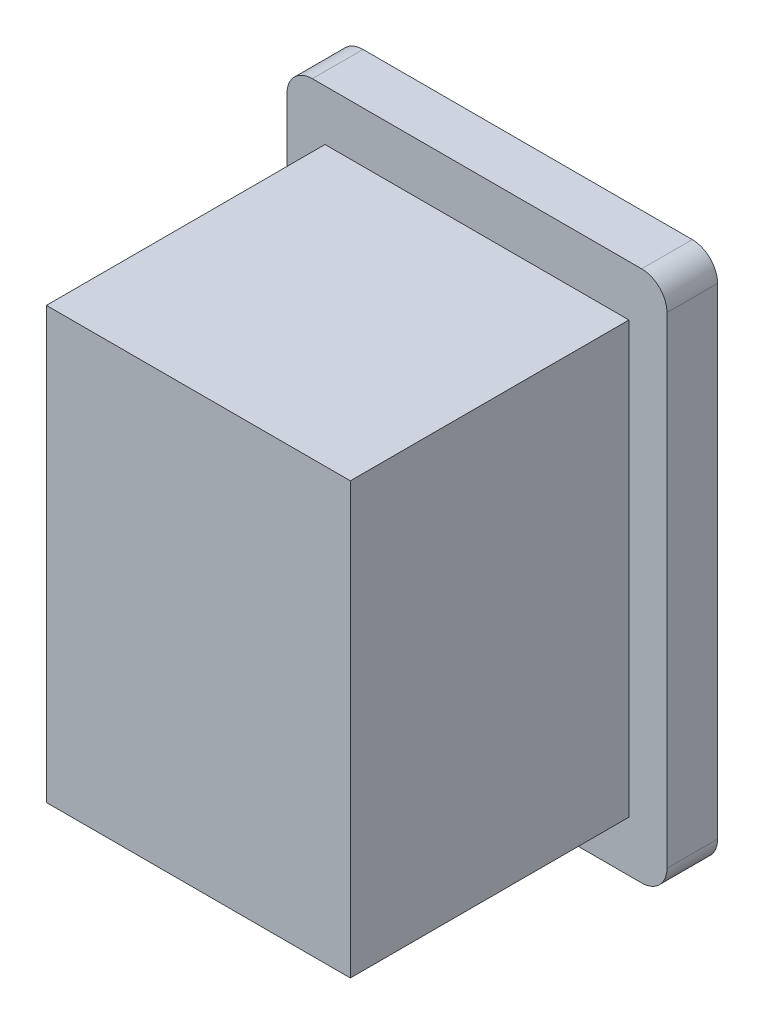
ISO-10303-21;
HEADER;
FILE_DESCRIPTION(('STEP AP214'),'2;1');
FILE_NAME('part.step','',(''),(''),'','','');
FILE_SCHEMA(('AUTOMOTIVE_DESIGN { 1 0 10303 214 1 1 1 1 }'));
ENDSEC;
DATA;
#1=APPLICATION_CONTEXT('core data for automotive mechanical design processes');
#2=APPLICATION_PROTOCOL_DEFINITION('international standard','automotive_design',2000,#1);
#3=PRODUCT_CONTEXT('',#1,'mechanical');
#4=PRODUCT('Part','Part','',(#3));
#5=PRODUCT_RELATED_PRODUCT_CATEGORY('part','',(#4));
#6=PRODUCT_DEFINITION_FORMATION('','',#4);
#7=PRODUCT_DEFINITION_CONTEXT('part definition',#1,'design');
#8=PRODUCT_DEFINITION('design','',#6,#7);
#9=PRODUCT_DEFINITION_SHAPE('','',#8);
#10=(LENGTH_UNIT() NAMED_UNIT(*) SI_UNIT(.MILLI.,.METRE.));
#11=(NAMED_UNIT(*) PLANE_ANGLE_UNIT() SI_UNIT($,.RADIAN.));
#12=(NAMED_UNIT(*) SI_UNIT($,.STERADIAN.) SOLID_ANGLE_UNIT());
#13=UNCERTAINTY_MEASURE_WITH_UNIT(LENGTH_MEASURE(1.E-05),#10,'distance_accuracy_value','');
#14=(GEOMETRIC_REPRESENTATION_CONTEXT(3) GLOBAL_UNCERTAINTY_ASSIGNED_CONTEXT((#13)) GLOBAL_UNIT_ASSIGNED_CONTEXT((#10,
#11,#12)) REPRESENTATION_CONTEXT('',''));
#15=CARTESIAN_POINT('',(0.,0.,0.));
#16=DIRECTION('',(0.,0.,1.));
#17=DIRECTION('',(1.,0.,0.));
#18=AXIS2_PLACEMENT_3D('',#15,#16,#17);
#19=CARTESIAN_POINT('',(6.,8.5,13.));
#20=DIRECTION('',(-1.,0.,0.));
#21=DIRECTION('',(0.,-1.,0.));
#22=AXIS2_PLACEMENT_3D('',#19,#20,#21);
#23=PLANE('',#22);
#24=DIRECTION('',(0.,0.,-1.));
#25=VECTOR('',#24,1.);
#26=CARTESIAN_POINT('',(6.,-8.5,13.));
#27=LINE('',#26,#25);
#28=CARTESIAN_POINT('',(6.,-8.5,13.));
#29=VERTEX_POINT('',#28);
#30=CARTESIAN_POINT('',(6.,-8.5,2.));
#31=VERTEX_POINT('',#30);
#32=EDGE_CURVE('E151',#29,#31,#27,.T.);
#33=ORIENTED_EDGE('',*,*,#32,.T.);
#34=DIRECTION('',(0.,1.,0.));
#35=VECTOR('',#34,1.);
#36=CARTESIAN_POINT('',(6.,8.5,2.));
#37=LINE('',#36,#35);
#38=CARTESIAN_POINT('',(6.,8.5,2.));
#39=VERTEX_POINT('',#38);
#40=EDGE_CURVE('E129',#31,#39,#37,.T.);
#41=ORIENTED_EDGE('',*,*,#40,.T.);
#42=DIRECTION('',(0.,0.,-1.));
#43=VECTOR('',#42,1.);
#44=CARTESIAN_POINT('',(6.,8.5,13.));
#45=LINE('',#44,#43);
#46=CARTESIAN_POINT('',(6.,8.5,13.));
#47=VERTEX_POINT('',#46);
#48=EDGE_CURVE('E135',#47,#39,#45,.T.);
#49=ORIENTED_EDGE('',*,*,#48,.F.);
#50=DIRECTION('',(0.,1.,0.));
#51=VECTOR('',#50,1.);
#52=CARTESIAN_POINT('',(6.,8.5,13.));
#53=LINE('',#52,#51);
#54=EDGE_CURVE('E211',#29,#47,#53,.T.);
#55=ORIENTED_EDGE('',*,*,#54,.F.);
#56=EDGE_LOOP('',(#33,#41,#49,#55));
#57=FACE_BOUND('',#56,.T.);
#58=ADVANCED_FACE('F35',(#57),#23,.F.);
#59=CARTESIAN_POINT('',(-6.,8.5,13.));
#60=DIRECTION('',(0.,-1.,0.));
#61=DIRECTION('',(0.,0.,-1.));
#62=AXIS2_PLACEMENT_3D('',#59,#60,#61);
#63=PLANE('',#62);
#64=ORIENTED_EDGE('',*,*,#48,.T.);
#65=DIRECTION('',(-1.,0.,0.));
#66=VECTOR('',#65,1.);
#67=CARTESIAN_POINT('',(-6.,8.5,2.));
#68=LINE('',#67,#66);
#69=CARTESIAN_POINT('',(-6.,8.5,2.));
#70=VERTEX_POINT('',#69);
#71=EDGE_CURVE('E146',#39,#70,#68,.T.);
#72=ORIENTED_EDGE('',*,*,#71,.T.);
#73=DIRECTION('',(0.,0.,-1.));
#74=VECTOR('',#73,1.);
#75=CARTESIAN_POINT('',(-6.,8.5,13.));
#76=LINE('',#75,#74);
#77=CARTESIAN_POINT('',(-6.,8.5,13.));
#78=VERTEX_POINT('',#77);
#79=EDGE_CURVE('E145',#78,#70,#76,.T.);
#80=ORIENTED_EDGE('',*,*,#79,.F.);
#81=DIRECTION('',(-1.,0.,0.));
#82=VECTOR('',#81,1.);
#83=CARTESIAN_POINT('',(-6.,8.5,13.));
#84=LINE('',#83,#82);
#85=EDGE_CURVE('E214',#47,#78,#84,.T.);
#86=ORIENTED_EDGE('',*,*,#85,.F.);
#87=EDGE_LOOP('',(#64,#72,#80,#86));
#88=FACE_BOUND('',#87,.T.);
#89=ADVANCED_FACE('F223',(#88),#63,.F.);
#90=CARTESIAN_POINT('',(-6.,8.5,13.));
#91=DIRECTION('',(1.,0.,0.));
#92=DIRECTION('',(0.,1.,0.));
#93=AXIS2_PLACEMENT_3D('',#90,#91,#92);
#94=PLANE('',#93);
#95=ORIENTED_EDGE('',*,*,#79,.T.);
#96=DIRECTION('',(0.,-1.,0.));
#97=VECTOR('',#96,1.);
#98=CARTESIAN_POINT('',(-6.,8.5,2.));
#99=LINE('',#98,#97);
#100=CARTESIAN_POINT('',(-6.,-8.5,2.));
#101=VERTEX_POINT('',#100);
#102=EDGE_CURVE('E126',#70,#101,#99,.T.);
#103=ORIENTED_EDGE('',*,*,#102,.T.);
#104=DIRECTION('',(0.,0.,-1.));
#105=VECTOR('',#104,1.);
#106=CARTESIAN_POINT('',(-6.,-8.5,13.));
#107=LINE('',#106,#105);
#108=CARTESIAN_POINT('',(-6.,-8.5,13.));
#109=VERTEX_POINT('',#108);
#110=EDGE_CURVE('E142',#109,#101,#107,.T.);
#111=ORIENTED_EDGE('',*,*,#110,.F.);
#112=DIRECTION('',(0.,-1.,0.));
#113=VECTOR('',#112,1.);
#114=CARTESIAN_POINT('',(-6.,8.5,13.));
#115=LINE('',#114,#113);
#116=EDGE_CURVE('E216',#78,#109,#115,.T.);
#117=ORIENTED_EDGE('',*,*,#116,.F.);
#118=EDGE_LOOP('',(#95,#103,#111,#117));
#119=FACE_BOUND('',#118,.T.);
#120=ADVANCED_FACE('F140',(#119),#94,.F.);
#121=CARTESIAN_POINT('',(-6.,-8.5,13.));
#122=DIRECTION('',(0.,1.,0.));
#123=DIRECTION('',(0.,0.,1.));
#124=AXIS2_PLACEMENT_3D('',#121,#122,#123);
#125=PLANE('',#124);
#126=ORIENTED_EDGE('',*,*,#110,.T.);
#127=DIRECTION('',(1.,0.,0.));
#128=VECTOR('',#127,1.);
#129=CARTESIAN_POINT('',(-6.,-8.5,2.));
#130=LINE('',#129,#128);
#131=EDGE_CURVE('E123',#101,#31,#130,.T.);
#132=ORIENTED_EDGE('',*,*,#131,.T.);
#133=ORIENTED_EDGE('',*,*,#32,.F.);
#134=DIRECTION('',(1.,0.,0.));
#135=VECTOR('',#134,1.);
#136=CARTESIAN_POINT('',(-6.,-8.5,13.));
#137=LINE('',#136,#135);
#138=EDGE_CURVE('E150',#109,#29,#137,.T.);
#139=ORIENTED_EDGE('',*,*,#138,.F.);
#140=EDGE_LOOP('',(#126,#132,#133,#139));
#141=FACE_BOUND('',#140,.T.);
#142=ADVANCED_FACE('F149',(#141),#125,.F.);
#143=CARTESIAN_POINT('',(0.,0.,13.));
#144=DIRECTION('',(0.,0.,1.));
#145=DIRECTION('',(1.,0.,0.));
#146=AXIS2_PLACEMENT_3D('',#143,#144,#145);
#147=PLANE('',#146);
#148=ORIENTED_EDGE('',*,*,#54,.T.);
#149=ORIENTED_EDGE('',*,*,#85,.T.);
#150=ORIENTED_EDGE('',*,*,#116,.T.);
#151=ORIENTED_EDGE('',*,*,#138,.T.);
#152=EDGE_LOOP('',(#148,#149,#150,#151));
#153=FACE_BOUND('',#152,.T.);
#154=ADVANCED_FACE('F218',(#153),#147,.T.);
#155=CARTESIAN_POINT('',(0.,0.,2.));
#156=DIRECTION('',(0.,0.,1.));
#157=DIRECTION('',(1.,0.,0.));
#158=AXIS2_PLACEMENT_3D('',#155,#156,#157);
#159=PLANE('',#158);
#160=DIRECTION('',(0.,-1.,0.));
#161=VECTOR('',#160,1.);
#162=CARTESIAN_POINT('',(-7.5,-10.5,2.));
#163=LINE('',#162,#161);
#164=CARTESIAN_POINT('',(-7.5,9.49999999999999,2.));
#165=VERTEX_POINT('',#164);
#166=CARTESIAN_POINT('',(-7.5,-9.5,2.));
#167=VERTEX_POINT('',#166);
#168=EDGE_CURVE('E199',#165,#167,#163,.T.);
#169=ORIENTED_EDGE('',*,*,#168,.T.);
#170=CARTESIAN_POINT('',(-6.5,-9.5,2.));
#171=DIRECTION('',(0.,0.,1.));
#172=DIRECTION('',(1.,0.,0.));
#173=AXIS2_PLACEMENT_3D('',#170,#171,#172);
#174=CIRCLE('',#173,1.);
#175=CARTESIAN_POINT('',(-6.5,-10.5,2.));
#176=VERTEX_POINT('',#175);
#177=EDGE_CURVE('E181',#167,#176,#174,.T.);
#178=ORIENTED_EDGE('',*,*,#177,.T.);
#179=DIRECTION('',(1.,0.,0.));
#180=VECTOR('',#179,1.);
#181=CARTESIAN_POINT('',(7.5,-10.5,2.));
#182=LINE('',#181,#180);
#183=CARTESIAN_POINT('',(6.5,-10.5,2.));
#184=VERTEX_POINT('',#183);
#185=EDGE_CURVE('E203',#176,#184,#182,.T.);
#186=ORIENTED_EDGE('',*,*,#185,.T.);
#187=CARTESIAN_POINT('',(6.5,-9.5,2.));
#188=DIRECTION('',(0.,0.,1.));
#189=DIRECTION('',(1.,0.,0.));
#190=AXIS2_PLACEMENT_3D('',#187,#188,#189);
#191=CIRCLE('',#190,1.);
#192=CARTESIAN_POINT('',(7.5,-9.5,2.));
#193=VERTEX_POINT('',#192);
#194=EDGE_CURVE('E179',#184,#193,#191,.T.);
#195=ORIENTED_EDGE('',*,*,#194,.T.);
#196=DIRECTION('',(0.,1.,0.));
#197=VECTOR('',#196,1.);
#198=CARTESIAN_POINT('',(7.5,-10.5,2.));
#199=LINE('',#198,#197);
#200=CARTESIAN_POINT('',(7.5,9.49999999999999,2.));
#201=VERTEX_POINT('',#200);
#202=EDGE_CURVE('E264',#193,#201,#199,.T.);
#203=ORIENTED_EDGE('',*,*,#202,.T.);
#204=CARTESIAN_POINT('',(6.5,9.5,2.));
#205=DIRECTION('',(0.,0.,1.));
#206=DIRECTION('',(1.,0.,0.));
#207=AXIS2_PLACEMENT_3D('',#204,#205,#206);
#208=CIRCLE('',#207,1.);
#209=CARTESIAN_POINT('',(6.5,10.5,2.));
#210=VERTEX_POINT('',#209);
#211=EDGE_CURVE('E55',#201,#210,#208,.T.);
#212=ORIENTED_EDGE('',*,*,#211,.T.);
#213=DIRECTION('',(-1.,0.,0.));
#214=VECTOR('',#213,1.);
#215=CARTESIAN_POINT('',(7.5,10.5,2.));
#216=LINE('',#215,#214);
#217=CARTESIAN_POINT('',(-6.5,10.5,2.));
#218=VERTEX_POINT('',#217);
#219=EDGE_CURVE('E147',#210,#218,#216,.T.);
#220=ORIENTED_EDGE('',*,*,#219,.T.);
#221=CARTESIAN_POINT('',(-6.5,9.5,2.));
#222=DIRECTION('',(0.,0.,1.));
#223=DIRECTION('',(1.,0.,0.));
#224=AXIS2_PLACEMENT_3D('',#221,#222,#223);
#225=CIRCLE('',#224,1.);
#226=EDGE_CURVE('E177',#218,#165,#225,.T.);
#227=ORIENTED_EDGE('',*,*,#226,.T.);
#228=EDGE_LOOP('',(#169,#178,#186,#195,#203,#212,#220,#227));
#229=FACE_BOUND('',#228,.T.);
#230=ORIENTED_EDGE('',*,*,#40,.F.);
#231=ORIENTED_EDGE('',*,*,#131,.F.);
#232=ORIENTED_EDGE('',*,*,#102,.F.);
#233=ORIENTED_EDGE('',*,*,#71,.F.);
#234=EDGE_LOOP('',(#230,#231,#232,#233));
#235=FACE_BOUND('',#234,.T.);
#236=ADVANCED_FACE('F125',(#229,#235),#159,.T.);
#237=CARTESIAN_POINT('',(-7.5,-10.5,2.));
#238=DIRECTION('',(1.,0.,0.));
#239=DIRECTION('',(0.,0.,-1.));
#240=AXIS2_PLACEMENT_3D('',#237,#238,#239);
#241=PLANE('',#240);
#242=DIRECTION('',(0.,-1.,0.));
#243=VECTOR('',#242,1.);
#244=CARTESIAN_POINT('',(-7.5,-10.5,0.));
#245=LINE('',#244,#243);
#246=CARTESIAN_POINT('',(-7.5,9.49999999999999,0.));
#247=VERTEX_POINT('',#246);
#248=CARTESIAN_POINT('',(-7.5,-9.5,0.));
#249=VERTEX_POINT('',#248);
#250=EDGE_CURVE('E255',#247,#249,#245,.T.);
#251=ORIENTED_EDGE('',*,*,#250,.T.);
#252=DIRECTION('',(0.,0.,-1.));
#253=VECTOR('',#252,1.);
#254=CARTESIAN_POINT('',(-7.5,-9.5,2.));
#255=LINE('',#254,#253);
#256=EDGE_CURVE('E174',#249,#167,#255,.F.);
#257=ORIENTED_EDGE('',*,*,#256,.T.);
#258=ORIENTED_EDGE('',*,*,#168,.F.);
#259=DIRECTION('',(0.,0.,-1.));
#260=VECTOR('',#259,1.);
#261=CARTESIAN_POINT('',(-7.5,9.5,2.));
#262=LINE('',#261,#260);
#263=EDGE_CURVE('E171',#165,#247,#262,.T.);
#264=ORIENTED_EDGE('',*,*,#263,.T.);
#265=EDGE_LOOP('',(#251,#257,#258,#264));
#266=FACE_BOUND('',#265,.T.);
#267=ADVANCED_FACE('F253',(#266),#241,.F.);
#268=CARTESIAN_POINT('',(7.5,-10.5,2.));
#269=DIRECTION('',(0.,1.,0.));
#270=DIRECTION('',(-1.,0.,0.));
#271=AXIS2_PLACEMENT_3D('',#268,#269,#270);
#272=PLANE('',#271);
#273=ORIENTED_EDGE('',*,*,#185,.F.);
#274=DIRECTION('',(0.,0.,-1.));
#275=VECTOR('',#274,1.);
#276=CARTESIAN_POINT('',(-6.5,-10.5,2.));
#277=LINE('',#276,#275);
#278=CARTESIAN_POINT('',(-6.5,-10.5,0.));
#279=VERTEX_POINT('',#278);
#280=EDGE_CURVE('E160',#176,#279,#277,.T.);
#281=ORIENTED_EDGE('',*,*,#280,.T.);
#282=DIRECTION('',(1.,0.,0.));
#283=VECTOR('',#282,1.);
#284=CARTESIAN_POINT('',(7.5,-10.5,0.));
#285=LINE('',#284,#283);
#286=CARTESIAN_POINT('',(6.5,-10.5,0.));
#287=VERTEX_POINT('',#286);
#288=EDGE_CURVE('E205',#279,#287,#285,.T.);
#289=ORIENTED_EDGE('',*,*,#288,.T.);
#290=DIRECTION('',(0.,0.,-1.));
#291=VECTOR('',#290,1.);
#292=CARTESIAN_POINT('',(6.5,-10.5,2.));
#293=LINE('',#292,#291);
#294=EDGE_CURVE('E134',#287,#184,#293,.F.);
#295=ORIENTED_EDGE('',*,*,#294,.T.);
#296=EDGE_LOOP('',(#273,#281,#289,#295));
#297=FACE_BOUND('',#296,.T.);
#298=ADVANCED_FACE('F261',(#297),#272,.F.);
#299=CARTESIAN_POINT('',(7.5,-10.5,2.));
#300=DIRECTION('',(-1.,0.,0.));
#301=DIRECTION('',(0.,0.,1.));
#302=AXIS2_PLACEMENT_3D('',#299,#300,#301);
#303=PLANE('',#302);
#304=ORIENTED_EDGE('',*,*,#202,.F.);
#305=DIRECTION('',(0.,0.,-1.));
#306=VECTOR('',#305,1.);
#307=CARTESIAN_POINT('',(7.5,-9.5,2.));
#308=LINE('',#307,#306);
#309=CARTESIAN_POINT('',(7.5,-9.5,0.));
#310=VERTEX_POINT('',#309);
#311=EDGE_CURVE('E185',#193,#310,#308,.T.);
#312=ORIENTED_EDGE('',*,*,#311,.T.);
#313=DIRECTION('',(0.,1.,0.));
#314=VECTOR('',#313,1.);
#315=CARTESIAN_POINT('',(7.5,-10.5,0.));
#316=LINE('',#315,#314);
#317=CARTESIAN_POINT('',(7.5,9.49999999999999,0.));
#318=VERTEX_POINT('',#317);
#319=EDGE_CURVE('E200',#310,#318,#316,.T.);
#320=ORIENTED_EDGE('',*,*,#319,.T.);
#321=DIRECTION('',(0.,0.,-1.));
#322=VECTOR('',#321,1.);
#323=CARTESIAN_POINT('',(7.5,9.5,2.));
#324=LINE('',#323,#322);
#325=EDGE_CURVE('E183',#318,#201,#324,.F.);
#326=ORIENTED_EDGE('',*,*,#325,.T.);
#327=EDGE_LOOP('',(#304,#312,#320,#326));
#328=FACE_BOUND('',#327,.T.);
#329=ADVANCED_FACE('F272',(#328),#303,.F.);
#330=CARTESIAN_POINT('',(7.5,10.5,2.));
#331=DIRECTION('',(0.,-1.,0.));
#332=DIRECTION('',(1.,0.,0.));
#333=AXIS2_PLACEMENT_3D('',#330,#331,#332);
#334=PLANE('',#333);
#335=DIRECTION('',(-1.,0.,0.));
#336=VECTOR('',#335,1.);
#337=CARTESIAN_POINT('',(7.5,10.5,0.));
#338=LINE('',#337,#336);
#339=CARTESIAN_POINT('',(6.5,10.5,0.));
#340=VERTEX_POINT('',#339);
#341=CARTESIAN_POINT('',(-6.5,10.5,0.));
#342=VERTEX_POINT('',#341);
#343=EDGE_CURVE('E191',#340,#342,#338,.T.);
#344=ORIENTED_EDGE('',*,*,#343,.T.);
#345=DIRECTION('',(0.,0.,-1.));
#346=VECTOR('',#345,1.);
#347=CARTESIAN_POINT('',(-6.5,10.5,2.));
#348=LINE('',#347,#346);
#349=EDGE_CURVE('E11',#342,#218,#348,.F.);
#350=ORIENTED_EDGE('',*,*,#349,.T.);
#351=ORIENTED_EDGE('',*,*,#219,.F.);
#352=DIRECTION('',(0.,0.,-1.));
#353=VECTOR('',#352,1.);
#354=CARTESIAN_POINT('',(6.5,10.5,2.));
#355=LINE('',#354,#353);
#356=EDGE_CURVE('E43',#210,#340,#355,.T.);
#357=ORIENTED_EDGE('',*,*,#356,.T.);
#358=EDGE_LOOP('',(#344,#350,#351,#357));
#359=FACE_BOUND('',#358,.T.);
#360=ADVANCED_FACE('F190',(#359),#334,.F.);
#361=CARTESIAN_POINT('',(0.,0.,0.));
#362=DIRECTION('',(0.,0.,1.));
#363=DIRECTION('',(1.,0.,0.));
#364=AXIS2_PLACEMENT_3D('',#361,#362,#363);
#365=PLANE('',#364);
#366=ORIENTED_EDGE('',*,*,#288,.F.);
#367=CARTESIAN_POINT('',(-6.5,-9.5,0.));
#368=DIRECTION('',(0.,0.,1.));
#369=DIRECTION('',(1.,0.,0.));
#370=AXIS2_PLACEMENT_3D('',#367,#368,#369);
#371=CIRCLE('',#370,1.);
#372=EDGE_CURVE('E169',#279,#249,#371,.F.);
#373=ORIENTED_EDGE('',*,*,#372,.T.);
#374=ORIENTED_EDGE('',*,*,#250,.F.);
#375=CARTESIAN_POINT('',(-6.5,9.5,0.));
#376=DIRECTION('',(0.,0.,1.));
#377=DIRECTION('',(1.,0.,0.));
#378=AXIS2_PLACEMENT_3D('',#375,#376,#377);
#379=CIRCLE('',#378,1.);
#380=EDGE_CURVE('E165',#247,#342,#379,.F.);
#381=ORIENTED_EDGE('',*,*,#380,.T.);
#382=ORIENTED_EDGE('',*,*,#343,.F.);
#383=CARTESIAN_POINT('',(6.5,9.5,0.));
#384=DIRECTION('',(0.,0.,1.));
#385=DIRECTION('',(1.,0.,0.));
#386=AXIS2_PLACEMENT_3D('',#383,#384,#385);
#387=CIRCLE('',#386,1.);
#388=EDGE_CURVE('E163',#340,#318,#387,.F.);
#389=ORIENTED_EDGE('',*,*,#388,.T.);
#390=ORIENTED_EDGE('',*,*,#319,.F.);
#391=CARTESIAN_POINT('',(6.5,-9.5,0.));
#392=DIRECTION('',(0.,0.,1.));
#393=DIRECTION('',(1.,0.,0.));
#394=AXIS2_PLACEMENT_3D('',#391,#392,#393);
#395=CIRCLE('',#394,1.);
#396=EDGE_CURVE('E167',#310,#287,#395,.F.);
#397=ORIENTED_EDGE('',*,*,#396,.T.);
#398=EDGE_LOOP('',(#366,#373,#374,#381,#382,#389,#390,#397));
#399=FACE_BOUND('',#398,.T.);
#400=ADVANCED_FACE('F195',(#399),#365,.F.);
#401=CARTESIAN_POINT('',(-6.5,-9.5,2.));
#402=DIRECTION('',(0.,0.,-1.));
#403=DIRECTION('',(-1.,0.,0.));
#404=AXIS2_PLACEMENT_3D('',#401,#402,#403);
#405=CYLINDRICAL_SURFACE('',#404,1.);
#406=ORIENTED_EDGE('',*,*,#177,.F.);
#407=ORIENTED_EDGE('',*,*,#256,.F.);
#408=ORIENTED_EDGE('',*,*,#372,.F.);
#409=ORIENTED_EDGE('',*,*,#280,.F.);
#410=EDGE_LOOP('',(#406,#407,#408,#409));
#411=FACE_BOUND('',#410,.T.);
#412=ADVANCED_FACE('F234',(#411),#405,.T.);
#413=CARTESIAN_POINT('',(6.5,-9.5,2.));
#414=DIRECTION('',(0.,0.,-1.));
#415=DIRECTION('',(-1.,0.,0.));
#416=AXIS2_PLACEMENT_3D('',#413,#414,#415);
#417=CYLINDRICAL_SURFACE('',#416,1.);
#418=ORIENTED_EDGE('',*,*,#194,.F.);
#419=ORIENTED_EDGE('',*,*,#294,.F.);
#420=ORIENTED_EDGE('',*,*,#396,.F.);
#421=ORIENTED_EDGE('',*,*,#311,.F.);
#422=EDGE_LOOP('',(#418,#419,#420,#421));
#423=FACE_BOUND('',#422,.T.);
#424=ADVANCED_FACE('F237',(#423),#417,.T.);
#425=CARTESIAN_POINT('',(-6.5,9.5,2.));
#426=DIRECTION('',(0.,0.,-1.));
#427=DIRECTION('',(-1.,0.,0.));
#428=AXIS2_PLACEMENT_3D('',#425,#426,#427);
#429=CYLINDRICAL_SURFACE('',#428,1.);
#430=ORIENTED_EDGE('',*,*,#226,.F.);
#431=ORIENTED_EDGE('',*,*,#349,.F.);
#432=ORIENTED_EDGE('',*,*,#380,.F.);
#433=ORIENTED_EDGE('',*,*,#263,.F.);
#434=EDGE_LOOP('',(#430,#431,#432,#433));
#435=FACE_BOUND('',#434,.T.);
#436=ADVANCED_FACE('F240',(#435),#429,.T.);
#437=CARTESIAN_POINT('',(6.5,9.5,2.));
#438=DIRECTION('',(0.,0.,-1.));
#439=DIRECTION('',(-1.,0.,0.));
#440=AXIS2_PLACEMENT_3D('',#437,#438,#439);
#441=CYLINDRICAL_SURFACE('',#440,1.);
#442=ORIENTED_EDGE('',*,*,#211,.F.);
#443=ORIENTED_EDGE('',*,*,#325,.F.);
#444=ORIENTED_EDGE('',*,*,#388,.F.);
#445=ORIENTED_EDGE('',*,*,#356,.F.);
#446=EDGE_LOOP('',(#442,#443,#444,#445));
#447=FACE_BOUND('',#446,.T.);
#448=ADVANCED_FACE('F37',(#447),#441,.T.);
#449=CLOSED_SHELL('',(#58,#89,#120,#142,#154,#236,#267,#298,#329,#360,#400,#412,#424,#436,#448));
#450=MANIFOLD_SOLID_BREP('B2',#449);
#451=ADVANCED_BREP_SHAPE_REPRESENTATION('',(#18,#450),#14);
#452=SHAPE_DEFINITION_REPRESENTATION(#9,#451);
ENDSEC;
END-ISO-10303-21;
